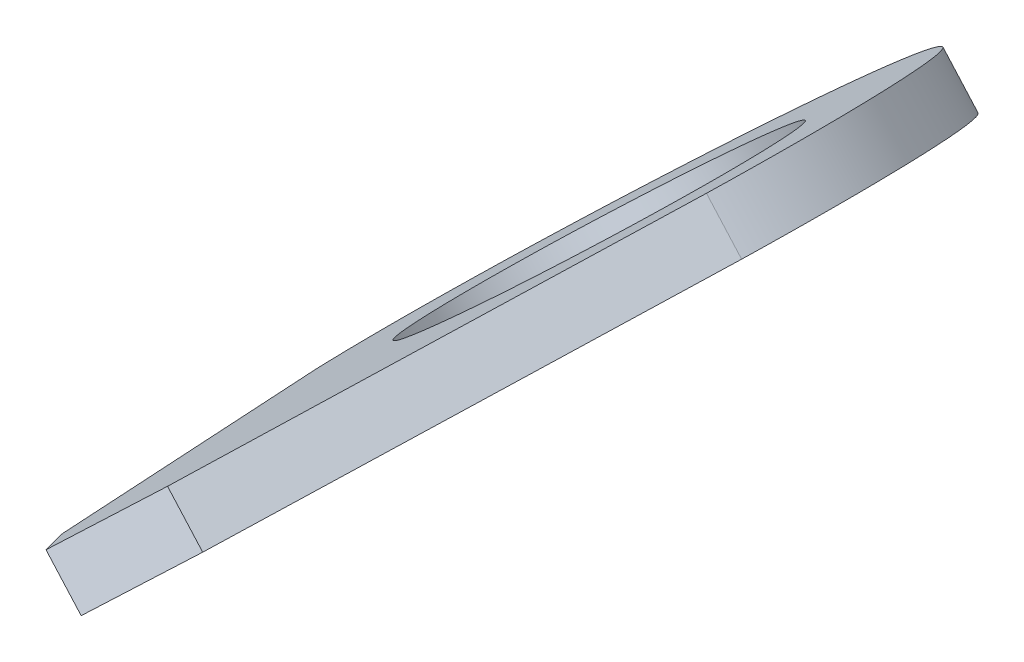
ISO-10303-21;
HEADER;
FILE_DESCRIPTION(('STEP AP214'),'2;1');
FILE_NAME('part.step','',(''),(''),'','','');
FILE_SCHEMA(('AUTOMOTIVE_DESIGN { 1 0 10303 214 1 1 1 1 }'));
ENDSEC;
DATA;
#1=APPLICATION_CONTEXT('core data for automotive mechanical design processes');
#2=APPLICATION_PROTOCOL_DEFINITION('international standard','automotive_design',2000,#1);
#3=PRODUCT_CONTEXT('',#1,'mechanical');
#4=PRODUCT('Part','Part','',(#3));
#5=PRODUCT_RELATED_PRODUCT_CATEGORY('part','',(#4));
#6=PRODUCT_DEFINITION_FORMATION('','',#4);
#7=PRODUCT_DEFINITION_CONTEXT('part definition',#1,'design');
#8=PRODUCT_DEFINITION('design','',#6,#7);
#9=PRODUCT_DEFINITION_SHAPE('','',#8);
#10=(LENGTH_UNIT() NAMED_UNIT(*) SI_UNIT(.MILLI.,.METRE.));
#11=(NAMED_UNIT(*) PLANE_ANGLE_UNIT() SI_UNIT($,.RADIAN.));
#12=(NAMED_UNIT(*) SI_UNIT($,.STERADIAN.) SOLID_ANGLE_UNIT());
#13=UNCERTAINTY_MEASURE_WITH_UNIT(LENGTH_MEASURE(1.E-05),#10,'distance_accuracy_value','');
#14=(GEOMETRIC_REPRESENTATION_CONTEXT(3) GLOBAL_UNCERTAINTY_ASSIGNED_CONTEXT((#13)) GLOBAL_UNIT_ASSIGNED_CONTEXT((#10,
#11,#12)) REPRESENTATION_CONTEXT('',''));
#15=CARTESIAN_POINT('',(0.,0.,0.));
#16=DIRECTION('',(0.,0.,1.));
#17=DIRECTION('',(1.,0.,0.));
#18=AXIS2_PLACEMENT_3D('',#15,#16,#17);
#19=CARTESIAN_POINT('',(25.4146588019186,-40.3124816007722,-35.5582499999999));
#20=DIRECTION('',(0.664699798962186,-0.747110552234159,0.));
#21=DIRECTION('',(0.747110552234159,0.664699798962186,0.));
#22=AXIS2_PLACEMENT_3D('',#19,#20,#21);
#23=PLANE('',#22);
#24=CARTESIAN_POINT('',(33.8511666617474,-32.8065709137902,-37.5584999999999));
#25=DIRECTION('',(-0.664699798962186,0.747110552234159,0.));
#26=DIRECTION('',(-0.747110552234159,-0.664699798962186,0.));
#27=AXIS2_PLACEMENT_3D('',#24,#25,#26);
#28=CIRCLE('',#27,2.38125);
#29=CARTESIAN_POINT('',(32.0721096592398,-34.3893873100689,-37.5584999999999));
#30=VERTEX_POINT('',#29);
#31=EDGE_CURVE('E101',#30,#30,#28,.T.);
#32=ORIENTED_EDGE('',*,*,#31,.T.);
#33=EDGE_LOOP('',(#32));
#34=FACE_BOUND('',#33,.T.);
#35=DIRECTION('',(0.533339101758297,0.474508615434761,-0.700279213181313));
#36=VECTOR('',#35,1.);
#37=CARTESIAN_POINT('',(33.8511666617474,-32.8065709137902,-29.5892499999999));
#38=LINE('',#37,#36);
#39=CARTESIAN_POINT('',(33.8511666617474,-32.8065709137902,-29.5892499999999));
#40=VERTEX_POINT('',#39);
#41=CARTESIAN_POINT('',(34.608253184852,-32.1329955530894,-30.5833116635119));
#42=VERTEX_POINT('',#41);
#43=EDGE_CURVE('E80',#40,#42,#38,.T.);
#44=ORIENTED_EDGE('',*,*,#43,.F.);
#45=DIRECTION('',(-0.533339101758139,-0.474508615434934,-0.700279213181316));
#46=VECTOR('',#45,1.);
#47=CARTESIAN_POINT('',(33.8511666617474,-32.8065709137902,-29.5892499999998));
#48=LINE('',#47,#46);
#49=CARTESIAN_POINT('',(33.0940801386432,-33.4801462744911,-30.5833116635118));
#50=VERTEX_POINT('',#49);
#51=EDGE_CURVE('E91',#40,#50,#48,.T.);
#52=ORIENTED_EDGE('',*,*,#51,.T.);
#53=DIRECTION('',(0.324014529778754,0.288273793163161,0.901062042629461));
#54=VECTOR('',#53,1.);
#55=CARTESIAN_POINT('',(30.1972102803793,-36.0574740965242,-38.6393067866357));
#56=LINE('',#55,#54);
#57=CARTESIAN_POINT('',(31.0406817940178,-35.3070425253607,-36.2936707267408));
#58=VERTEX_POINT('',#57);
#59=EDGE_CURVE('E74',#50,#58,#56,.F.);
#60=ORIENTED_EDGE('',*,*,#59,.T.);
#61=CARTESIAN_POINT('',(33.8511666617475,-32.8065709137903,-37.5584999999999));
#62=DIRECTION('',(-0.664699798962185,0.747110552234159,0.));
#63=DIRECTION('',(-0.747110552234159,-0.664699798962185,0.));
#64=AXIS2_PLACEMENT_3D('',#61,#62,#63);
#65=CIRCLE('',#64,3.96875);
#66=CARTESIAN_POINT('',(36.6616515294772,-30.3060993022199,-36.2936707267407));
#67=VERTEX_POINT('',#66);
#68=EDGE_CURVE('E19',#67,#58,#65,.T.);
#69=ORIENTED_EDGE('',*,*,#68,.F.);
#70=DIRECTION('',(-0.324014529778756,-0.288273793163162,0.90106204262946));
#71=VECTOR('',#70,1.);
#72=CARTESIAN_POINT('',(34.3315248396054,-32.3791991101166,-29.8137492361984));
#73=LINE('',#72,#71);
#74=EDGE_CURVE('E62',#42,#67,#73,.F.);
#75=ORIENTED_EDGE('',*,*,#74,.F.);
#76=EDGE_LOOP('',(#44,#52,#60,#69,#75));
#77=FACE_BOUND('',#76,.T.);
#78=ADVANCED_FACE('F16',(#34,#77),#23,.T.);
#79=CARTESIAN_POINT('',(33.8511666617474,-32.8065709137902,-37.5584999999999));
#80=DIRECTION('',(-0.664699798962185,0.747110552234159,0.));
#81=DIRECTION('',(-0.747110552234159,-0.664699798962185,0.));
#82=AXIS2_PLACEMENT_3D('',#79,#80,#81);
#83=CYLINDRICAL_SURFACE('',#82,3.96875);
#84=DIRECTION('',(-0.664699798962185,0.747110552234159,0.));
#85=VECTOR('',#84,1.);
#86=CARTESIAN_POINT('',(36.6616515294771,-30.3060993022197,-36.2936707267409));
#87=LINE('',#86,#85);
#88=CARTESIAN_POINT('',(36.1551502826681,-29.7368010614173,-36.2936707267413));
#89=VERTEX_POINT('',#88);
#90=EDGE_CURVE('E67',#67,#89,#87,.T.);
#91=ORIENTED_EDGE('',*,*,#90,.F.);
#92=ORIENTED_EDGE('',*,*,#68,.T.);
#93=DIRECTION('',(-0.664699798962185,0.747110552234159,0.));
#94=VECTOR('',#93,1.);
#95=CARTESIAN_POINT('',(31.0406817940177,-35.3070425253606,-36.2936707267409));
#96=LINE('',#95,#94);
#97=CARTESIAN_POINT('',(30.5341805472082,-34.7377442845583,-36.2936707267419));
#98=VERTEX_POINT('',#97);
#99=EDGE_CURVE('E88',#58,#98,#96,.T.);
#100=ORIENTED_EDGE('',*,*,#99,.T.);
#101=CARTESIAN_POINT('',(33.3446654149382,-32.2372726729877,-37.5584999999999));
#102=DIRECTION('',(-0.664699798962185,0.747110552234159,0.));
#103=DIRECTION('',(-0.747110552234159,-0.664699798962185,0.));
#104=AXIS2_PLACEMENT_3D('',#101,#102,#103);
#105=CIRCLE('',#104,3.96875);
#106=EDGE_CURVE('E79',#98,#89,#105,.F.);
#107=ORIENTED_EDGE('',*,*,#106,.T.);
#108=EDGE_LOOP('',(#91,#92,#100,#107));
#109=FACE_BOUND('',#108,.T.);
#110=ADVANCED_FACE('F78',(#109),#83,.T.);
#111=CARTESIAN_POINT('',(34.3315248396052,-32.3791991101164,-29.8137492361984));
#112=DIRECTION('',(0.673192960266135,0.598935758588258,0.433690206636518));
#113=DIRECTION('',(-0.664699798962185,0.747110552234159,0.));
#114=AXIS2_PLACEMENT_3D('',#111,#112,#113);
#115=PLANE('',#114);
#116=ORIENTED_EDGE('',*,*,#74,.T.);
#117=ORIENTED_EDGE('',*,*,#90,.T.);
#118=DIRECTION('',(-0.324014529778752,-0.288273793163159,0.901062042629462));
#119=VECTOR('',#118,1.);
#120=CARTESIAN_POINT('',(36.1551502826678,-29.7368010614174,-36.293670726741));
#121=LINE('',#120,#119);
#122=CARTESIAN_POINT('',(34.1017519380426,-31.5636973122869,-30.5833116635119));
#123=VERTEX_POINT('',#122);
#124=EDGE_CURVE('E100',#89,#123,#121,.T.);
#125=ORIENTED_EDGE('',*,*,#124,.T.);
#126=DIRECTION('',(-0.664699798962281,0.747110552234074,1.27486239704274E-13));
#127=VECTOR('',#126,1.);
#128=CARTESIAN_POINT('',(34.608253184852,-32.1329955530894,-30.5833116635119));
#129=LINE('',#128,#127);
#130=EDGE_CURVE('E69',#42,#123,#129,.T.);
#131=ORIENTED_EDGE('',*,*,#130,.F.);
#132=EDGE_LOOP('',(#116,#117,#125,#131));
#133=FACE_BOUND('',#132,.T.);
#134=ADVANCED_FACE('F64',(#133),#115,.T.);
#135=CARTESIAN_POINT('',(31.7811857731688,-34.648220555037,-26.8713457938852));
#136=DIRECTION('',(0.523185989677994,0.465475452219016,0.713869052128022));
#137=DIRECTION('',(0.806576293472948,0.,-0.591130004996736));
#138=AXIS2_PLACEMENT_3D('',#135,#136,#137);
#139=PLANE('',#138);
#140=ORIENTED_EDGE('',*,*,#43,.T.);
#141=ORIENTED_EDGE('',*,*,#130,.T.);
#142=DIRECTION('',(-0.533339101758145,-0.47450861543474,0.700279213181443));
#143=VECTOR('',#142,1.);
#144=CARTESIAN_POINT('',(34.1017519380426,-31.563697312287,-30.5833116635119));
#145=LINE('',#144,#143);
#146=CARTESIAN_POINT('',(33.3446654149383,-32.2372726729876,-29.5892499999998));
#147=VERTEX_POINT('',#146);
#148=EDGE_CURVE('E116',#123,#147,#145,.T.);
#149=ORIENTED_EDGE('',*,*,#148,.T.);
#150=DIRECTION('',(0.664699798962093,-0.747110552234241,-1.2293315971489E-13));
#151=VECTOR('',#150,1.);
#152=CARTESIAN_POINT('',(33.3446654149383,-32.2372726729877,-29.5892499999998));
#153=LINE('',#152,#151);
#154=EDGE_CURVE('E93',#147,#40,#153,.T.);
#155=ORIENTED_EDGE('',*,*,#154,.T.);
#156=EDGE_LOOP('',(#140,#141,#149,#155));
#157=FACE_BOUND('',#156,.T.);
#158=ADVANCED_FACE('F128',(#157),#139,.T.);
#159=CARTESIAN_POINT('',(27.3225064844769,-38.6150809051788,-38.1614416825431));
#160=DIRECTION('',(0.523185989677995,0.465475452219018,-0.71386905212802));
#161=DIRECTION('',(-0.806576293472947,0.,-0.591130004996737));
#162=AXIS2_PLACEMENT_3D('',#159,#160,#161);
#163=PLANE('',#162);
#164=DIRECTION('',(-0.664699798962185,0.747110552234159,0.));
#165=VECTOR('',#164,1.);
#166=CARTESIAN_POINT('',(33.094080138643,-33.480146274491,-30.5833116635119));
#167=LINE('',#166,#165);
#168=CARTESIAN_POINT('',(32.5875788918338,-32.9108480336885,-30.5833116635119));
#169=VERTEX_POINT('',#168);
#170=EDGE_CURVE('E34',#169,#50,#167,.F.);
#171=ORIENTED_EDGE('',*,*,#170,.T.);
#172=ORIENTED_EDGE('',*,*,#51,.F.);
#173=ORIENTED_EDGE('',*,*,#154,.F.);
#174=DIRECTION('',(-0.533339101758244,-0.474508615434826,-0.70027921318131));
#175=VECTOR('',#174,1.);
#176=CARTESIAN_POINT('',(33.3446654149383,-32.2372726729876,-29.5892499999999));
#177=LINE('',#176,#175);
#178=EDGE_CURVE('E113',#147,#169,#177,.T.);
#179=ORIENTED_EDGE('',*,*,#178,.T.);
#180=EDGE_LOOP('',(#171,#172,#173,#179));
#181=FACE_BOUND('',#180,.T.);
#182=ADVANCED_FACE('F137',(#181),#163,.F.);
#183=CARTESIAN_POINT('',(30.1972102803791,-36.057474096524,-38.6393067866357));
#184=DIRECTION('',(0.673192960266136,0.598935758588259,-0.433690206636516));
#185=DIRECTION('',(-0.664699798962185,0.747110552234159,0.));
#186=AXIS2_PLACEMENT_3D('',#183,#184,#185);
#187=PLANE('',#186);
#188=ORIENTED_EDGE('',*,*,#99,.F.);
#189=ORIENTED_EDGE('',*,*,#59,.F.);
#190=ORIENTED_EDGE('',*,*,#170,.F.);
#191=DIRECTION('',(-0.324014529778735,-0.288273793163143,-0.901062042629473));
#192=VECTOR('',#191,1.);
#193=CARTESIAN_POINT('',(32.5875788918338,-32.9108480336885,-30.5833116635119));
#194=LINE('',#193,#192);
#195=EDGE_CURVE('E25',#169,#98,#194,.T.);
#196=ORIENTED_EDGE('',*,*,#195,.T.);
#197=EDGE_LOOP('',(#188,#189,#190,#196));
#198=FACE_BOUND('',#197,.T.);
#199=ADVANCED_FACE('F135',(#198),#187,.F.);
#200=CARTESIAN_POINT('',(33.8511666617474,-32.8065709137902,-37.5584999999999));
#201=DIRECTION('',(-0.664699798962186,0.747110552234159,0.));
#202=DIRECTION('',(-0.747110552234159,-0.664699798962186,0.));
#203=AXIS2_PLACEMENT_3D('',#200,#201,#202);
#204=CYLINDRICAL_SURFACE('',#203,2.38125);
#205=CARTESIAN_POINT('',(33.3446654149382,-32.2372726729877,-37.5584999999999));
#206=DIRECTION('',(-0.664699798962186,0.747110552234159,0.));
#207=DIRECTION('',(-0.747110552234159,-0.664699798962186,0.));
#208=AXIS2_PLACEMENT_3D('',#205,#206,#207);
#209=CIRCLE('',#208,2.38125);
#210=CARTESIAN_POINT('',(31.5656084124306,-33.8200890692665,-37.5584999999999));
#211=VERTEX_POINT('',#210);
#212=EDGE_CURVE('E11',#211,#211,#209,.T.);
#213=ORIENTED_EDGE('',*,*,#212,.T.);
#214=EDGE_LOOP('',(#213));
#215=FACE_BOUND('',#214,.T.);
#216=ORIENTED_EDGE('',*,*,#31,.F.);
#217=EDGE_LOOP('',(#216));
#218=FACE_BOUND('',#217,.T.);
#219=ADVANCED_FACE('F146',(#215,#218),#204,.F.);
#220=CARTESIAN_POINT('',(24.9081575551091,-39.7431833599696,-35.5582499999999));
#221=DIRECTION('',(0.664699798962186,-0.747110552234159,0.));
#222=DIRECTION('',(0.747110552234159,0.664699798962186,0.));
#223=AXIS2_PLACEMENT_3D('',#220,#221,#222);
#224=PLANE('',#223);
#225=ORIENTED_EDGE('',*,*,#212,.F.);
#226=EDGE_LOOP('',(#225));
#227=FACE_BOUND('',#226,.T.);
#228=ORIENTED_EDGE('',*,*,#178,.F.);
#229=ORIENTED_EDGE('',*,*,#148,.F.);
#230=ORIENTED_EDGE('',*,*,#124,.F.);
#231=ORIENTED_EDGE('',*,*,#106,.F.);
#232=ORIENTED_EDGE('',*,*,#195,.F.);
#233=EDGE_LOOP('',(#228,#229,#230,#231,#232));
#234=FACE_BOUND('',#233,.T.);
#235=ADVANCED_FACE('F131',(#227,#234),#224,.F.);
#236=CLOSED_SHELL('',(#78,#110,#134,#158,#182,#199,#219,#235));
#237=MANIFOLD_SOLID_BREP('B1',#236);
#238=ADVANCED_BREP_SHAPE_REPRESENTATION('',(#18,#237),#14);
#239=SHAPE_DEFINITION_REPRESENTATION(#9,#238);
ENDSEC;
END-ISO-10303-21;
